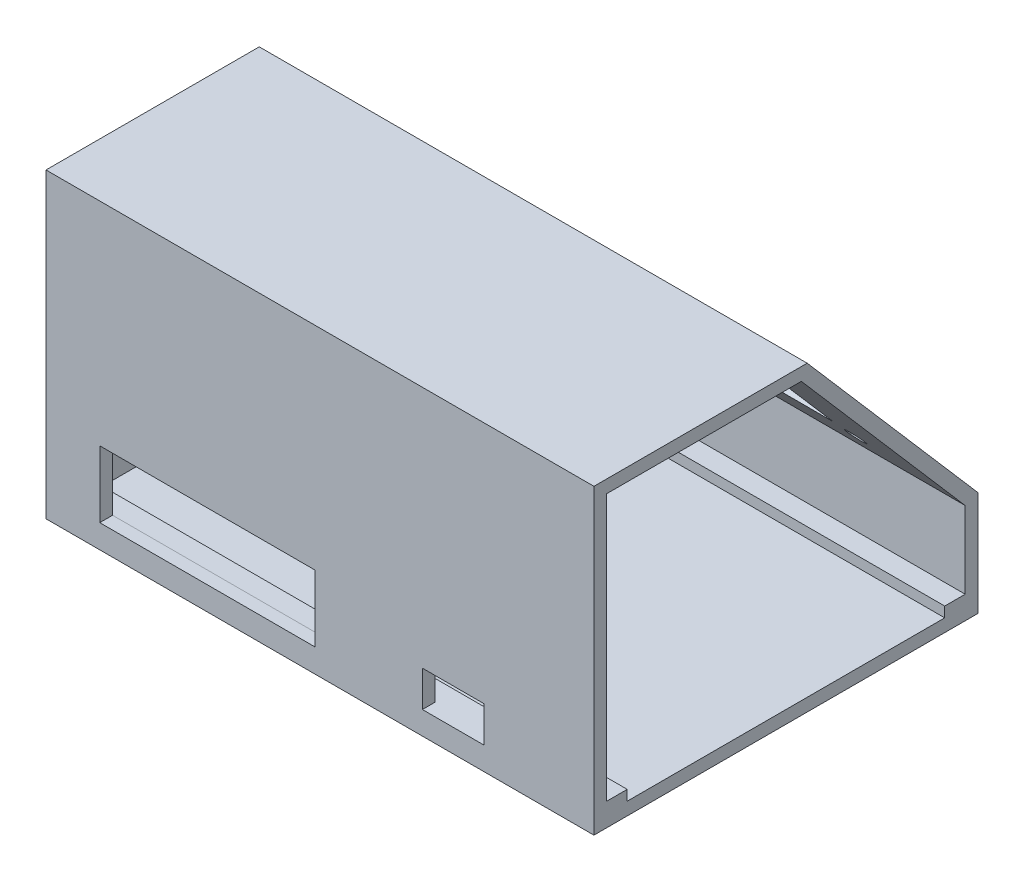
ISO-10303-21;
HEADER;
FILE_DESCRIPTION(('STEP AP214'),'2;1');
FILE_NAME('part.step','',(''),(''),'','','');
FILE_SCHEMA(('AUTOMOTIVE_DESIGN { 1 0 10303 214 1 1 1 1 }'));
ENDSEC;
DATA;
#1=APPLICATION_CONTEXT('core data for automotive mechanical design processes');
#2=APPLICATION_PROTOCOL_DEFINITION('international standard','automotive_design',2000,#1);
#3=PRODUCT_CONTEXT('',#1,'mechanical');
#4=PRODUCT('Part','Part','',(#3));
#5=PRODUCT_RELATED_PRODUCT_CATEGORY('part','',(#4));
#6=PRODUCT_DEFINITION_FORMATION('','',#4);
#7=PRODUCT_DEFINITION_CONTEXT('part definition',#1,'design');
#8=PRODUCT_DEFINITION('design','',#6,#7);
#9=PRODUCT_DEFINITION_SHAPE('','',#8);
#10=(LENGTH_UNIT() NAMED_UNIT(*) SI_UNIT(.MILLI.,.METRE.));
#11=(NAMED_UNIT(*) PLANE_ANGLE_UNIT() SI_UNIT($,.RADIAN.));
#12=(NAMED_UNIT(*) SI_UNIT($,.STERADIAN.) SOLID_ANGLE_UNIT());
#13=UNCERTAINTY_MEASURE_WITH_UNIT(LENGTH_MEASURE(1.E-05),#10,'distance_accuracy_value','');
#14=(GEOMETRIC_REPRESENTATION_CONTEXT(3) GLOBAL_UNCERTAINTY_ASSIGNED_CONTEXT((#13)) GLOBAL_UNIT_ASSIGNED_CONTEXT((#10,
#11,#12)) REPRESENTATION_CONTEXT('',''));
#15=CARTESIAN_POINT('',(0.,0.,0.));
#16=DIRECTION('',(0.,0.,1.));
#17=DIRECTION('',(1.,0.,0.));
#18=AXIS2_PLACEMENT_3D('',#15,#16,#17);
#19=CARTESIAN_POINT('',(2.5,-4.81741573033708,0.));
#20=DIRECTION('',(0.,1.,0.));
#21=DIRECTION('',(0.,0.,1.));
#22=AXIS2_PLACEMENT_3D('',#19,#20,#21);
#23=PLANE('',#22);
#24=DIRECTION('',(0.,0.,1.));
#25=VECTOR('',#24,1.);
#26=CARTESIAN_POINT('',(107.,-4.81741573033708,0.));
#27=LINE('',#26,#25);
#28=CARTESIAN_POINT('',(107.,-4.81741573033708,4.));
#29=VERTEX_POINT('',#28);
#30=CARTESIAN_POINT('',(107.,-4.81741573033708,66.));
#31=VERTEX_POINT('',#30);
#32=EDGE_CURVE('E337',#29,#31,#27,.T.);
#33=ORIENTED_EDGE('',*,*,#32,.F.);
#34=DIRECTION('',(-1.,0.,0.));
#35=VECTOR('',#34,1.);
#36=CARTESIAN_POINT('',(107.,-4.81741573033708,4.));
#37=LINE('',#36,#35);
#38=CARTESIAN_POINT('',(2.5,-4.81741573033708,4.));
#39=VERTEX_POINT('',#38);
#40=EDGE_CURVE('E308',#29,#39,#37,.T.);
#41=ORIENTED_EDGE('',*,*,#40,.T.);
#42=DIRECTION('',(0.,0.,1.));
#43=VECTOR('',#42,1.);
#44=CARTESIAN_POINT('',(2.5,-4.81741573033708,0.));
#45=LINE('',#44,#43);
#46=CARTESIAN_POINT('',(2.5,-4.81741573033708,66.));
#47=VERTEX_POINT('',#46);
#48=EDGE_CURVE('E338',#39,#47,#45,.T.);
#49=ORIENTED_EDGE('',*,*,#48,.T.);
#50=DIRECTION('',(-1.,0.,0.));
#51=VECTOR('',#50,1.);
#52=CARTESIAN_POINT('',(107.,-4.81741573033708,66.));
#53=LINE('',#52,#51);
#54=EDGE_CURVE('E334',#31,#47,#53,.T.);
#55=ORIENTED_EDGE('',*,*,#54,.F.);
#56=EDGE_LOOP('',(#33,#41,#49,#55));
#57=FACE_BOUND('',#56,.T.);
#58=ADVANCED_FACE('F44',(#57),#23,.T.);
#59=CARTESIAN_POINT('',(2.5,0.,0.));
#60=DIRECTION('',(1.,0.,0.));
#61=DIRECTION('',(0.,0.,-1.));
#62=AXIS2_PLACEMENT_3D('',#59,#60,#61);
#63=PLANE('',#62);
#64=DIRECTION('',(0.,-1.,0.));
#65=VECTOR('',#64,1.);
#66=CARTESIAN_POINT('',(2.5,-4.81741573033708,4.));
#67=LINE('',#66,#65);
#68=CARTESIAN_POINT('',(2.5,-2.81741573033708,4.));
#69=VERTEX_POINT('',#68);
#70=EDGE_CURVE('E306',#69,#39,#67,.T.);
#71=ORIENTED_EDGE('',*,*,#70,.F.);
#72=DIRECTION('',(0.,0.,1.));
#73=VECTOR('',#72,1.);
#74=CARTESIAN_POINT('',(2.5,-2.81741573033708,4.));
#75=LINE('',#74,#73);
#76=CARTESIAN_POINT('',(2.5,-2.81741573033708,0.));
#77=VERTEX_POINT('',#76);
#78=EDGE_CURVE('E302',#77,#69,#75,.T.);
#79=ORIENTED_EDGE('',*,*,#78,.F.);
#80=DIRECTION('',(0.,-1.,0.));
#81=VECTOR('',#80,1.);
#82=CARTESIAN_POINT('',(2.5,0.,0.));
#83=LINE('',#82,#81);
#84=CARTESIAN_POINT('',(2.5,12.1825842696629,0.));
#85=VERTEX_POINT('',#84);
#86=EDGE_CURVE('E340',#85,#77,#83,.T.);
#87=ORIENTED_EDGE('',*,*,#86,.F.);
#88=DIRECTION('',(0.,-0.756363172452144,-0.654151932931584));
#89=VECTOR('',#88,1.);
#90=CARTESIAN_POINT('',(2.5,5.21310751865226,-6.02765556844167));
#91=LINE('',#90,#89);
#92=CARTESIAN_POINT('',(2.5,49.1825842696629,32.));
#93=VERTEX_POINT('',#92);
#94=EDGE_CURVE('E344',#93,#85,#91,.T.);
#95=ORIENTED_EDGE('',*,*,#94,.F.);
#96=DIRECTION('',(0.,0.,-1.));
#97=VECTOR('',#96,1.);
#98=CARTESIAN_POINT('',(2.5,49.1825842696629,0.));
#99=LINE('',#98,#97);
#100=CARTESIAN_POINT('',(2.5,49.1825842696629,70.));
#101=VERTEX_POINT('',#100);
#102=EDGE_CURVE('E346',#101,#93,#99,.T.);
#103=ORIENTED_EDGE('',*,*,#102,.F.);
#104=DIRECTION('',(0.,1.,0.));
#105=VECTOR('',#104,1.);
#106=CARTESIAN_POINT('',(2.5,0.,70.));
#107=LINE('',#106,#105);
#108=CARTESIAN_POINT('',(2.5,-2.81741573033708,70.));
#109=VERTEX_POINT('',#108);
#110=EDGE_CURVE('E348',#109,#101,#107,.T.);
#111=ORIENTED_EDGE('',*,*,#110,.F.);
#112=DIRECTION('',(0.,0.,1.));
#113=VECTOR('',#112,1.);
#114=CARTESIAN_POINT('',(2.5,-2.81741573033708,70.));
#115=LINE('',#114,#113);
#116=CARTESIAN_POINT('',(2.5,-2.81741573033708,66.));
#117=VERTEX_POINT('',#116);
#118=EDGE_CURVE('E322',#117,#109,#115,.T.);
#119=ORIENTED_EDGE('',*,*,#118,.F.);
#120=DIRECTION('',(0.,1.,0.));
#121=VECTOR('',#120,1.);
#122=CARTESIAN_POINT('',(2.5,-2.81741573033708,66.));
#123=LINE('',#122,#121);
#124=EDGE_CURVE('E318',#47,#117,#123,.T.);
#125=ORIENTED_EDGE('',*,*,#124,.F.);
#126=ORIENTED_EDGE('',*,*,#48,.F.);
#127=EDGE_LOOP('',(#71,#79,#87,#95,#103,#111,#119,#125,#126));
#128=FACE_BOUND('',#127,.T.);
#129=ADVANCED_FACE('F466',(#128),#63,.T.);
#130=CARTESIAN_POINT('',(2.5,0.,0.));
#131=DIRECTION('',(0.,0.,1.));
#132=DIRECTION('',(1.,0.,0.));
#133=AXIS2_PLACEMENT_3D('',#130,#131,#132);
#134=PLANE('',#133);
#135=ORIENTED_EDGE('',*,*,#86,.T.);
#136=DIRECTION('',(-1.,0.,0.));
#137=VECTOR('',#136,1.);
#138=CARTESIAN_POINT('',(107.,-2.81741573033708,0.));
#139=LINE('',#138,#137);
#140=CARTESIAN_POINT('',(107.,-2.81741573033708,0.));
#141=VERTEX_POINT('',#140);
#142=EDGE_CURVE('E316',#141,#77,#139,.T.);
#143=ORIENTED_EDGE('',*,*,#142,.F.);
#144=DIRECTION('',(0.,-1.,0.));
#145=VECTOR('',#144,1.);
#146=CARTESIAN_POINT('',(107.,0.,0.));
#147=LINE('',#146,#145);
#148=CARTESIAN_POINT('',(107.,12.1825842696629,0.));
#149=VERTEX_POINT('',#148);
#150=EDGE_CURVE('E352',#149,#141,#147,.T.);
#151=ORIENTED_EDGE('',*,*,#150,.F.);
#152=DIRECTION('',(1.,0.,0.));
#153=VECTOR('',#152,1.);
#154=CARTESIAN_POINT('',(2.5,12.1825842696629,0.));
#155=LINE('',#154,#153);
#156=EDGE_CURVE('E350',#85,#149,#155,.T.);
#157=ORIENTED_EDGE('',*,*,#156,.F.);
#158=EDGE_LOOP('',(#135,#143,#151,#157));
#159=FACE_BOUND('',#158,.T.);
#160=ADVANCED_FACE('F472',(#159),#134,.T.);
#161=CARTESIAN_POINT('',(2.5,0.,70.));
#162=DIRECTION('',(0.,0.,-1.));
#163=DIRECTION('',(-1.,0.,0.));
#164=AXIS2_PLACEMENT_3D('',#161,#162,#163);
#165=PLANE('',#164);
#166=DIRECTION('',(0.,1.,0.));
#167=VECTOR('',#166,1.);
#168=CARTESIAN_POINT('',(73.5,0.,70.));
#169=LINE('',#168,#167);
#170=CARTESIAN_POINT('',(73.5,-2.81741573033708,70.));
#171=VERTEX_POINT('',#170);
#172=CARTESIAN_POINT('',(73.5,4.18258426966292,70.));
#173=VERTEX_POINT('',#172);
#174=EDGE_CURVE('E269',#171,#173,#169,.T.);
#175=ORIENTED_EDGE('',*,*,#174,.F.);
#176=DIRECTION('',(-1.,0.,0.));
#177=VECTOR('',#176,1.);
#178=CARTESIAN_POINT('',(107.,-2.81741573033708,70.));
#179=LINE('',#178,#177);
#180=EDGE_CURVE('E324',#171,#109,#179,.T.);
#181=ORIENTED_EDGE('',*,*,#180,.T.);
#182=ORIENTED_EDGE('',*,*,#110,.T.);
#183=DIRECTION('',(1.,0.,0.));
#184=VECTOR('',#183,1.);
#185=CARTESIAN_POINT('',(2.5,49.1825842696629,70.));
#186=LINE('',#185,#184);
#187=CARTESIAN_POINT('',(107.,49.1825842696629,70.));
#188=VERTEX_POINT('',#187);
#189=EDGE_CURVE('E362',#101,#188,#186,.T.);
#190=ORIENTED_EDGE('',*,*,#189,.T.);
#191=DIRECTION('',(0.,1.,0.));
#192=VECTOR('',#191,1.);
#193=CARTESIAN_POINT('',(107.,0.,70.));
#194=LINE('',#193,#192);
#195=CARTESIAN_POINT('',(107.,-2.81741573033708,70.));
#196=VERTEX_POINT('',#195);
#197=EDGE_CURVE('E341',#196,#188,#194,.T.);
#198=ORIENTED_EDGE('',*,*,#197,.F.);
#199=CARTESIAN_POINT('',(85.5,-2.81741573033708,70.));
#200=VERTEX_POINT('',#199);
#201=EDGE_CURVE('E329',#196,#200,#179,.T.);
#202=ORIENTED_EDGE('',*,*,#201,.T.);
#203=DIRECTION('',(0.,-1.,0.));
#204=VECTOR('',#203,1.);
#205=CARTESIAN_POINT('',(85.5,0.,70.));
#206=LINE('',#205,#204);
#207=CARTESIAN_POINT('',(85.5,4.18258426966292,70.));
#208=VERTEX_POINT('',#207);
#209=EDGE_CURVE('E260',#208,#200,#206,.T.);
#210=ORIENTED_EDGE('',*,*,#209,.F.);
#211=DIRECTION('',(1.,0.,0.));
#212=VECTOR('',#211,1.);
#213=CARTESIAN_POINT('',(2.5,4.18258426966292,70.));
#214=LINE('',#213,#212);
#215=EDGE_CURVE('E271',#173,#208,#214,.T.);
#216=ORIENTED_EDGE('',*,*,#215,.F.);
#217=EDGE_LOOP('',(#175,#181,#182,#190,#198,#202,#210,#216));
#218=FACE_BOUND('',#217,.T.);
#219=DIRECTION('',(0.,1.,0.));
#220=VECTOR('',#219,1.);
#221=CARTESIAN_POINT('',(10.5,0.,70.));
#222=LINE('',#221,#220);
#223=CARTESIAN_POINT('',(10.5,-2.71741573033708,70.));
#224=VERTEX_POINT('',#223);
#225=CARTESIAN_POINT('',(10.5,10.2825842696629,70.));
#226=VERTEX_POINT('',#225);
#227=EDGE_CURVE('E300',#224,#226,#222,.T.);
#228=ORIENTED_EDGE('',*,*,#227,.F.);
#229=DIRECTION('',(-1.,0.,0.));
#230=VECTOR('',#229,1.);
#231=CARTESIAN_POINT('',(2.5,-2.71741573033708,70.));
#232=LINE('',#231,#230);
#233=CARTESIAN_POINT('',(52.5,-2.71741573033708,70.));
#234=VERTEX_POINT('',#233);
#235=EDGE_CURVE('E287',#234,#224,#232,.T.);
#236=ORIENTED_EDGE('',*,*,#235,.F.);
#237=DIRECTION('',(0.,-1.,0.));
#238=VECTOR('',#237,1.);
#239=CARTESIAN_POINT('',(52.5,0.,70.));
#240=LINE('',#239,#238);
#241=CARTESIAN_POINT('',(52.5,10.2825842696629,70.));
#242=VERTEX_POINT('',#241);
#243=EDGE_CURVE('E295',#242,#234,#240,.T.);
#244=ORIENTED_EDGE('',*,*,#243,.F.);
#245=DIRECTION('',(1.,0.,0.));
#246=VECTOR('',#245,1.);
#247=CARTESIAN_POINT('',(2.5,10.2825842696629,70.));
#248=LINE('',#247,#246);
#249=EDGE_CURVE('E298',#226,#242,#248,.T.);
#250=ORIENTED_EDGE('',*,*,#249,.F.);
#251=EDGE_LOOP('',(#228,#236,#244,#250));
#252=FACE_BOUND('',#251,.T.);
#253=ADVANCED_FACE('F494',(#218,#252),#165,.T.);
#254=CARTESIAN_POINT('',(107.,0.,0.));
#255=DIRECTION('',(-1.,0.,0.));
#256=DIRECTION('',(0.,0.,1.));
#257=AXIS2_PLACEMENT_3D('',#254,#255,#256);
#258=PLANE('',#257);
#259=DIRECTION('',(0.,-1.,0.));
#260=VECTOR('',#259,1.);
#261=CARTESIAN_POINT('',(107.,-4.81741573033708,4.));
#262=LINE('',#261,#260);
#263=CARTESIAN_POINT('',(107.,-2.81741573033708,4.));
#264=VERTEX_POINT('',#263);
#265=EDGE_CURVE('E305',#264,#29,#262,.T.);
#266=ORIENTED_EDGE('',*,*,#265,.T.);
#267=ORIENTED_EDGE('',*,*,#32,.T.);
#268=DIRECTION('',(0.,1.,0.));
#269=VECTOR('',#268,1.);
#270=CARTESIAN_POINT('',(107.,-2.81741573033708,66.));
#271=LINE('',#270,#269);
#272=CARTESIAN_POINT('',(107.,-2.81741573033708,66.));
#273=VERTEX_POINT('',#272);
#274=EDGE_CURVE('E319',#31,#273,#271,.T.);
#275=ORIENTED_EDGE('',*,*,#274,.T.);
#276=DIRECTION('',(0.,0.,1.));
#277=VECTOR('',#276,1.);
#278=CARTESIAN_POINT('',(107.,-2.81741573033708,70.));
#279=LINE('',#278,#277);
#280=EDGE_CURVE('E321',#273,#196,#279,.T.);
#281=ORIENTED_EDGE('',*,*,#280,.T.);
#282=ORIENTED_EDGE('',*,*,#197,.T.);
#283=DIRECTION('',(0.,0.,-1.));
#284=VECTOR('',#283,1.);
#285=CARTESIAN_POINT('',(107.,49.1825842696629,0.));
#286=LINE('',#285,#284);
#287=CARTESIAN_POINT('',(107.,49.1825842696629,32.));
#288=VERTEX_POINT('',#287);
#289=EDGE_CURVE('E358',#188,#288,#286,.T.);
#290=ORIENTED_EDGE('',*,*,#289,.T.);
#291=DIRECTION('',(0.,-0.756363172452144,-0.654151932931584));
#292=VECTOR('',#291,1.);
#293=CARTESIAN_POINT('',(107.,5.21310751865226,-6.02765556844167));
#294=LINE('',#293,#292);
#295=EDGE_CURVE('E355',#288,#149,#294,.T.);
#296=ORIENTED_EDGE('',*,*,#295,.T.);
#297=ORIENTED_EDGE('',*,*,#150,.T.);
#298=DIRECTION('',(0.,0.,1.));
#299=VECTOR('',#298,1.);
#300=CARTESIAN_POINT('',(107.,-2.81741573033708,4.));
#301=LINE('',#300,#299);
#302=EDGE_CURVE('E303',#141,#264,#301,.T.);
#303=ORIENTED_EDGE('',*,*,#302,.T.);
#304=EDGE_LOOP('',(#266,#267,#275,#281,#282,#290,#296,#297,#303));
#305=FACE_BOUND('',#304,.T.);
#306=DIRECTION('',(0.,0.,-1.));
#307=VECTOR('',#306,1.);
#308=CARTESIAN_POINT('',(107.,-7.31741573033708,-2.5));
#309=LINE('',#308,#307);
#310=CARTESIAN_POINT('',(107.,-7.31741573033708,72.5));
#311=VERTEX_POINT('',#310);
#312=CARTESIAN_POINT('',(107.,-7.31741573033708,-2.5));
#313=VERTEX_POINT('',#312);
#314=EDGE_CURVE('E365',#311,#313,#309,.T.);
#315=ORIENTED_EDGE('',*,*,#314,.T.);
#316=DIRECTION('',(0.,1.,0.));
#317=VECTOR('',#316,1.);
#318=CARTESIAN_POINT('',(107.,13.1137013973614,-2.5));
#319=LINE('',#318,#317);
#320=CARTESIAN_POINT('',(107.,13.1137013973614,-2.5));
#321=VERTEX_POINT('',#320);
#322=EDGE_CURVE('E388',#313,#321,#319,.T.);
#323=ORIENTED_EDGE('',*,*,#322,.T.);
#324=DIRECTION('',(0.,0.756363172452144,0.654151932931584));
#325=VECTOR('',#324,1.);
#326=CARTESIAN_POINT('',(107.,51.6825842696629,30.8568716733419));
#327=LINE('',#326,#325);
#328=CARTESIAN_POINT('',(107.,51.6825842696629,30.8568716733419));
#329=VERTEX_POINT('',#328);
#330=EDGE_CURVE('E391',#321,#329,#327,.T.);
#331=ORIENTED_EDGE('',*,*,#330,.T.);
#332=DIRECTION('',(0.,0.,1.));
#333=VECTOR('',#332,1.);
#334=CARTESIAN_POINT('',(107.,51.6825842696629,72.5));
#335=LINE('',#334,#333);
#336=CARTESIAN_POINT('',(107.,51.6825842696629,72.5));
#337=VERTEX_POINT('',#336);
#338=EDGE_CURVE('E394',#329,#337,#335,.T.);
#339=ORIENTED_EDGE('',*,*,#338,.T.);
#340=DIRECTION('',(0.,-1.,0.));
#341=VECTOR('',#340,1.);
#342=CARTESIAN_POINT('',(107.,-7.31741573033708,72.5));
#343=LINE('',#342,#341);
#344=EDGE_CURVE('E373',#337,#311,#343,.T.);
#345=ORIENTED_EDGE('',*,*,#344,.T.);
#346=EDGE_LOOP('',(#315,#323,#331,#339,#345));
#347=FACE_BOUND('',#346,.T.);
#348=ADVANCED_FACE('F491',(#305,#347),#258,.F.);
#349=CARTESIAN_POINT('',(0.,-7.31741573033708,-2.5));
#350=DIRECTION('',(0.,-1.,0.));
#351=DIRECTION('',(0.,0.,-1.));
#352=AXIS2_PLACEMENT_3D('',#349,#350,#351);
#353=PLANE('',#352);
#354=ORIENTED_EDGE('',*,*,#314,.F.);
#355=DIRECTION('',(1.,0.,0.));
#356=VECTOR('',#355,1.);
#357=CARTESIAN_POINT('',(0.,-7.31741573033708,72.5));
#358=LINE('',#357,#356);
#359=CARTESIAN_POINT('',(0.,-7.31741573033708,72.5));
#360=VERTEX_POINT('',#359);
#361=EDGE_CURVE('E399',#360,#311,#358,.T.);
#362=ORIENTED_EDGE('',*,*,#361,.F.);
#363=DIRECTION('',(0.,0.,-1.));
#364=VECTOR('',#363,1.);
#365=CARTESIAN_POINT('',(0.,-7.31741573033708,-2.5));
#366=LINE('',#365,#364);
#367=CARTESIAN_POINT('',(0.,-7.31741573033708,-2.5));
#368=VERTEX_POINT('',#367);
#369=EDGE_CURVE('E369',#360,#368,#366,.T.);
#370=ORIENTED_EDGE('',*,*,#369,.T.);
#371=DIRECTION('',(1.,0.,0.));
#372=VECTOR('',#371,1.);
#373=CARTESIAN_POINT('',(0.,-7.31741573033708,-2.5));
#374=LINE('',#373,#372);
#375=EDGE_CURVE('E385',#368,#313,#374,.T.);
#376=ORIENTED_EDGE('',*,*,#375,.T.);
#377=EDGE_LOOP('',(#354,#362,#370,#376));
#378=FACE_BOUND('',#377,.T.);
#379=ADVANCED_FACE('F482',(#378),#353,.T.);
#380=CARTESIAN_POINT('',(0.,-7.31741573033708,72.5));
#381=DIRECTION('',(0.,0.,1.));
#382=DIRECTION('',(1.,0.,0.));
#383=AXIS2_PLACEMENT_3D('',#380,#381,#382);
#384=PLANE('',#383);
#385=DIRECTION('',(0.,-1.,0.));
#386=VECTOR('',#385,1.);
#387=CARTESIAN_POINT('',(73.5,4.18258426966292,72.5));
#388=LINE('',#387,#386);
#389=CARTESIAN_POINT('',(73.5,4.18258426966292,72.5));
#390=VERTEX_POINT('',#389);
#391=CARTESIAN_POINT('',(73.5,-2.81741573033708,72.5));
#392=VERTEX_POINT('',#391);
#393=EDGE_CURVE('E244',#390,#392,#388,.T.);
#394=ORIENTED_EDGE('',*,*,#393,.F.);
#395=DIRECTION('',(-1.,0.,0.));
#396=VECTOR('',#395,1.);
#397=CARTESIAN_POINT('',(73.5,4.18258426966292,72.5));
#398=LINE('',#397,#396);
#399=CARTESIAN_POINT('',(85.5,4.18258426966292,72.5));
#400=VERTEX_POINT('',#399);
#401=EDGE_CURVE('E254',#400,#390,#398,.T.);
#402=ORIENTED_EDGE('',*,*,#401,.F.);
#403=DIRECTION('',(0.,1.,0.));
#404=VECTOR('',#403,1.);
#405=CARTESIAN_POINT('',(85.5,4.18258426966292,72.5));
#406=LINE('',#405,#404);
#407=CARTESIAN_POINT('',(85.5,-2.81741573033708,72.5));
#408=VERTEX_POINT('',#407);
#409=EDGE_CURVE('E251',#408,#400,#406,.T.);
#410=ORIENTED_EDGE('',*,*,#409,.F.);
#411=DIRECTION('',(1.,0.,0.));
#412=VECTOR('',#411,1.);
#413=CARTESIAN_POINT('',(73.5,-2.81741573033708,72.5));
#414=LINE('',#413,#412);
#415=EDGE_CURVE('E248',#392,#408,#414,.T.);
#416=ORIENTED_EDGE('',*,*,#415,.F.);
#417=EDGE_LOOP('',(#394,#402,#410,#416));
#418=FACE_BOUND('',#417,.T.);
#419=DIRECTION('',(0.,-1.,0.));
#420=VECTOR('',#419,1.);
#421=CARTESIAN_POINT('',(10.5,-2.71741573033708,72.5));
#422=LINE('',#421,#420);
#423=CARTESIAN_POINT('',(10.5,10.2825842696629,72.5));
#424=VERTEX_POINT('',#423);
#425=CARTESIAN_POINT('',(10.5,-2.71741573033708,72.5));
#426=VERTEX_POINT('',#425);
#427=EDGE_CURVE('E273',#424,#426,#422,.T.);
#428=ORIENTED_EDGE('',*,*,#427,.F.);
#429=DIRECTION('',(-1.,0.,0.));
#430=VECTOR('',#429,1.);
#431=CARTESIAN_POINT('',(10.5,10.2825842696629,72.5));
#432=LINE('',#431,#430);
#433=CARTESIAN_POINT('',(52.5,10.2825842696629,72.5));
#434=VERTEX_POINT('',#433);
#435=EDGE_CURVE('E281',#434,#424,#432,.T.);
#436=ORIENTED_EDGE('',*,*,#435,.F.);
#437=DIRECTION('',(0.,1.,0.));
#438=VECTOR('',#437,1.);
#439=CARTESIAN_POINT('',(52.5,-2.71741573033708,72.5));
#440=LINE('',#439,#438);
#441=CARTESIAN_POINT('',(52.5,-2.71741573033708,72.5));
#442=VERTEX_POINT('',#441);
#443=EDGE_CURVE('E278',#442,#434,#440,.T.);
#444=ORIENTED_EDGE('',*,*,#443,.F.);
#445=DIRECTION('',(1.,0.,0.));
#446=VECTOR('',#445,1.);
#447=CARTESIAN_POINT('',(10.5,-2.71741573033708,72.5));
#448=LINE('',#447,#446);
#449=EDGE_CURVE('E275',#426,#442,#448,.T.);
#450=ORIENTED_EDGE('',*,*,#449,.F.);
#451=EDGE_LOOP('',(#428,#436,#444,#450));
#452=FACE_BOUND('',#451,.T.);
#453=ORIENTED_EDGE('',*,*,#344,.F.);
#454=DIRECTION('',(1.,0.,0.));
#455=VECTOR('',#454,1.);
#456=CARTESIAN_POINT('',(0.,51.6825842696629,72.5));
#457=LINE('',#456,#455);
#458=CARTESIAN_POINT('',(0.,51.6825842696629,72.5));
#459=VERTEX_POINT('',#458);
#460=EDGE_CURVE('E402',#459,#337,#457,.T.);
#461=ORIENTED_EDGE('',*,*,#460,.F.);
#462=DIRECTION('',(0.,-1.,0.));
#463=VECTOR('',#462,1.);
#464=CARTESIAN_POINT('',(0.,-7.31741573033708,72.5));
#465=LINE('',#464,#463);
#466=EDGE_CURVE('E382',#459,#360,#465,.T.);
#467=ORIENTED_EDGE('',*,*,#466,.T.);
#468=ORIENTED_EDGE('',*,*,#361,.T.);
#469=EDGE_LOOP('',(#453,#461,#467,#468));
#470=FACE_BOUND('',#469,.T.);
#471=ADVANCED_FACE('F479',(#418,#452,#470),#384,.T.);
#472=CARTESIAN_POINT('',(0.,51.6825842696629,72.5));
#473=DIRECTION('',(0.,1.,0.));
#474=DIRECTION('',(0.,0.,1.));
#475=AXIS2_PLACEMENT_3D('',#472,#473,#474);
#476=PLANE('',#475);
#477=ORIENTED_EDGE('',*,*,#338,.F.);
#478=DIRECTION('',(1.,0.,0.));
#479=VECTOR('',#478,1.);
#480=CARTESIAN_POINT('',(0.,51.6825842696629,30.8568716733419));
#481=LINE('',#480,#479);
#482=CARTESIAN_POINT('',(0.,51.6825842696629,30.8568716733419));
#483=VERTEX_POINT('',#482);
#484=EDGE_CURVE('E404',#483,#329,#481,.T.);
#485=ORIENTED_EDGE('',*,*,#484,.F.);
#486=DIRECTION('',(0.,0.,1.));
#487=VECTOR('',#486,1.);
#488=CARTESIAN_POINT('',(0.,51.6825842696629,72.5));
#489=LINE('',#488,#487);
#490=EDGE_CURVE('E379',#483,#459,#489,.T.);
#491=ORIENTED_EDGE('',*,*,#490,.T.);
#492=ORIENTED_EDGE('',*,*,#460,.T.);
#493=EDGE_LOOP('',(#477,#485,#491,#492));
#494=FACE_BOUND('',#493,.T.);
#495=ADVANCED_FACE('F445',(#494),#476,.T.);
#496=CARTESIAN_POINT('',(0.,51.6825842696629,30.8568716733419));
#497=DIRECTION('',(0.,0.654151932931584,-0.756363172452144));
#498=DIRECTION('',(0.,0.756363172452144,0.654151932931584));
#499=AXIS2_PLACEMENT_3D('',#496,#497,#498);
#500=PLANE('',#499);
#501=CARTESIAN_POINT('',(15.4068290893679,45.5182244141779,25.5255334199495));
#502=DIRECTION('',(0.,0.654151932931585,-0.756363172452144));
#503=DIRECTION('',(0.,0.756363172452144,0.654151932931584));
#504=AXIS2_PLACEMENT_3D('',#501,#502,#503);
#505=CIRCLE('',#504,1.85000000000001);
#506=CARTESIAN_POINT('',(15.4068290893679,46.9174962832144,26.7357144958729));
#507=VERTEX_POINT('',#506);
#508=EDGE_CURVE('E419',#507,#507,#505,.T.);
#509=ORIENTED_EDGE('',*,*,#508,.F.);
#510=EDGE_LOOP('',(#509));
#511=FACE_BOUND('',#510,.T.);
#512=CARTESIAN_POINT('',(15.4068290893675,20.7851486749928,4.13476521308668));
#513=DIRECTION('',(0.,0.654151932931585,-0.756363172452144));
#514=DIRECTION('',(0.,0.756363172452144,0.654151932931584));
#515=AXIS2_PLACEMENT_3D('',#512,#513,#514);
#516=CIRCLE('',#515,1.85000000000001);
#517=CARTESIAN_POINT('',(15.4068290893675,22.1844205440293,5.34494628901012));
#518=VERTEX_POINT('',#517);
#519=EDGE_CURVE('E434',#518,#518,#516,.T.);
#520=ORIENTED_EDGE('',*,*,#519,.F.);
#521=EDGE_LOOP('',(#520));
#522=FACE_BOUND('',#521,.T.);
#523=CARTESIAN_POINT('',(91.6068290893675,20.7851486749928,4.13476521308668));
#524=DIRECTION('',(0.,0.654151932931585,-0.756363172452144));
#525=DIRECTION('',(0.,0.756363172452144,0.654151932931584));
#526=AXIS2_PLACEMENT_3D('',#523,#524,#525);
#527=CIRCLE('',#526,1.85000000000001);
#528=CARTESIAN_POINT('',(91.6068290893675,22.1844205440293,5.34494628901012));
#529=VERTEX_POINT('',#528);
#530=EDGE_CURVE('E431',#529,#529,#527,.T.);
#531=ORIENTED_EDGE('',*,*,#530,.F.);
#532=EDGE_LOOP('',(#531));
#533=FACE_BOUND('',#532,.T.);
#534=CARTESIAN_POINT('',(91.6068290893679,45.5182244141779,25.5255334199495));
#535=DIRECTION('',(0.,0.654151932931585,-0.756363172452144));
#536=DIRECTION('',(0.,0.756363172452144,0.654151932931584));
#537=AXIS2_PLACEMENT_3D('',#534,#535,#536);
#538=CIRCLE('',#537,1.85000000000001);
#539=CARTESIAN_POINT('',(91.6068290893679,46.9174962832144,26.7357144958729));
#540=VERTEX_POINT('',#539);
#541=EDGE_CURVE('E415',#540,#540,#538,.T.);
#542=ORIENTED_EDGE('',*,*,#541,.F.);
#543=EDGE_LOOP('',(#542));
#544=FACE_BOUND('',#543,.T.);
#545=DIRECTION('',(0.,-0.756363172452144,-0.654151932931584));
#546=VECTOR('',#545,1.);
#547=CARTESIAN_POINT('',(89.5,23.3189653027075,6.32617418840749));
#548=LINE('',#547,#546);
#549=CARTESIAN_POINT('',(89.5,42.9844077864633,23.3341244446287));
#550=VERTEX_POINT('',#549);
#551=CARTESIAN_POINT('',(89.5,23.3189653027075,6.32617418840748));
#552=VERTEX_POINT('',#551);
#553=EDGE_CURVE('E61',#550,#552,#548,.T.);
#554=ORIENTED_EDGE('',*,*,#553,.F.);
#555=DIRECTION('',(1.,0.,0.));
#556=VECTOR('',#555,1.);
#557=CARTESIAN_POINT('',(17.5,42.9844077864633,23.3341244446287));
#558=LINE('',#557,#556);
#559=CARTESIAN_POINT('',(17.5,42.9844077864633,23.3341244446287));
#560=VERTEX_POINT('',#559);
#561=EDGE_CURVE('E237',#560,#550,#558,.T.);
#562=ORIENTED_EDGE('',*,*,#561,.F.);
#563=DIRECTION('',(0.,0.756363172452144,0.654151932931585));
#564=VECTOR('',#563,1.);
#565=CARTESIAN_POINT('',(17.5,23.3189653027075,6.3261741884075));
#566=LINE('',#565,#564);
#567=CARTESIAN_POINT('',(17.5,23.3189653027075,6.3261741884075));
#568=VERTEX_POINT('',#567);
#569=EDGE_CURVE('E221',#568,#560,#566,.T.);
#570=ORIENTED_EDGE('',*,*,#569,.F.);
#571=DIRECTION('',(-1.,0.,0.));
#572=VECTOR('',#571,1.);
#573=CARTESIAN_POINT('',(17.5,23.3189653027075,6.3261741884075));
#574=LINE('',#573,#572);
#575=EDGE_CURVE('E230',#552,#568,#574,.T.);
#576=ORIENTED_EDGE('',*,*,#575,.F.);
#577=EDGE_LOOP('',(#554,#562,#570,#576));
#578=FACE_BOUND('',#577,.T.);
#579=ORIENTED_EDGE('',*,*,#330,.F.);
#580=DIRECTION('',(1.,0.,0.));
#581=VECTOR('',#580,1.);
#582=CARTESIAN_POINT('',(0.,13.1137013973614,-2.5));
#583=LINE('',#582,#581);
#584=CARTESIAN_POINT('',(0.,13.1137013973614,-2.5));
#585=VERTEX_POINT('',#584);
#586=EDGE_CURVE('E406',#585,#321,#583,.T.);
#587=ORIENTED_EDGE('',*,*,#586,.F.);
#588=DIRECTION('',(0.,0.756363172452144,0.654151932931584));
#589=VECTOR('',#588,1.);
#590=CARTESIAN_POINT('',(0.,51.6825842696629,30.8568716733419));
#591=LINE('',#590,#589);
#592=EDGE_CURVE('E376',#585,#483,#591,.T.);
#593=ORIENTED_EDGE('',*,*,#592,.T.);
#594=ORIENTED_EDGE('',*,*,#484,.T.);
#595=EDGE_LOOP('',(#579,#587,#593,#594));
#596=FACE_BOUND('',#595,.T.);
#597=ADVANCED_FACE('F234',(#511,#522,#533,#544,#578,#596),#500,.T.);
#598=CARTESIAN_POINT('',(0.,13.1137013973614,-2.5));
#599=DIRECTION('',(0.,0.,-1.));
#600=DIRECTION('',(-1.,0.,0.));
#601=AXIS2_PLACEMENT_3D('',#598,#599,#600);
#602=PLANE('',#601);
#603=ORIENTED_EDGE('',*,*,#322,.F.);
#604=ORIENTED_EDGE('',*,*,#375,.F.);
#605=DIRECTION('',(0.,1.,0.));
#606=VECTOR('',#605,1.);
#607=CARTESIAN_POINT('',(0.,13.1137013973614,-2.5));
#608=LINE('',#607,#606);
#609=EDGE_CURVE('E372',#368,#585,#608,.T.);
#610=ORIENTED_EDGE('',*,*,#609,.T.);
#611=ORIENTED_EDGE('',*,*,#586,.T.);
#612=EDGE_LOOP('',(#603,#604,#610,#611));
#613=FACE_BOUND('',#612,.T.);
#614=ADVANCED_FACE('F444',(#613),#602,.T.);
#615=CARTESIAN_POINT('',(0.,0.,0.));
#616=DIRECTION('',(-1.,0.,0.));
#617=DIRECTION('',(0.,0.,1.));
#618=AXIS2_PLACEMENT_3D('',#615,#616,#617);
#619=PLANE('',#618);
#620=ORIENTED_EDGE('',*,*,#369,.F.);
#621=ORIENTED_EDGE('',*,*,#466,.F.);
#622=ORIENTED_EDGE('',*,*,#490,.F.);
#623=ORIENTED_EDGE('',*,*,#592,.F.);
#624=ORIENTED_EDGE('',*,*,#609,.F.);
#625=EDGE_LOOP('',(#620,#621,#622,#623,#624));
#626=FACE_BOUND('',#625,.T.);
#627=ADVANCED_FACE('F46',(#626),#619,.T.);
#628=CARTESIAN_POINT('',(2.5,49.1825842696629,0.));
#629=DIRECTION('',(0.,-1.,0.));
#630=DIRECTION('',(0.,0.,-1.));
#631=AXIS2_PLACEMENT_3D('',#628,#629,#630);
#632=PLANE('',#631);
#633=ORIENTED_EDGE('',*,*,#289,.F.);
#634=ORIENTED_EDGE('',*,*,#189,.F.);
#635=ORIENTED_EDGE('',*,*,#102,.T.);
#636=DIRECTION('',(1.,0.,0.));
#637=VECTOR('',#636,1.);
#638=CARTESIAN_POINT('',(2.5,49.1825842696629,32.));
#639=LINE('',#638,#637);
#640=EDGE_CURVE('E366',#93,#288,#639,.T.);
#641=ORIENTED_EDGE('',*,*,#640,.T.);
#642=EDGE_LOOP('',(#633,#634,#635,#641));
#643=FACE_BOUND('',#642,.T.);
#644=ADVANCED_FACE('F517',(#643),#632,.T.);
#645=CARTESIAN_POINT('',(2.5,5.21310751865226,-6.02765556844167));
#646=DIRECTION('',(0.,-0.654151932931584,0.756363172452144));
#647=DIRECTION('',(0.,-0.756363172452144,-0.654151932931584));
#648=AXIS2_PLACEMENT_3D('',#645,#646,#647);
#649=PLANE('',#648);
#650=CARTESIAN_POINT('',(15.4068290893679,43.882844581849,27.4164413510798));
#651=DIRECTION('',(0.,-0.654151932931584,0.756363172452144));
#652=DIRECTION('',(0.,-0.756363172452144,-0.654151932931584));
#653=AXIS2_PLACEMENT_3D('',#650,#651,#652);
#654=CIRCLE('',#653,1.85000000000001);
#655=CARTESIAN_POINT('',(15.4068290893679,42.4835727128125,26.2062602751564));
#656=VERTEX_POINT('',#655);
#657=EDGE_CURVE('E48',#656,#656,#654,.T.);
#658=ORIENTED_EDGE('',*,*,#657,.F.);
#659=EDGE_LOOP('',(#658));
#660=FACE_BOUND('',#659,.T.);
#661=CARTESIAN_POINT('',(15.4068290893675,19.1497688426639,6.02567314421704));
#662=DIRECTION('',(0.,-0.654151932931584,0.756363172452144));
#663=DIRECTION('',(0.,-0.756363172452144,-0.654151932931584));
#664=AXIS2_PLACEMENT_3D('',#661,#662,#663);
#665=CIRCLE('',#664,1.85000000000001);
#666=CARTESIAN_POINT('',(15.4068290893675,17.7504969736274,4.8154920682936));
#667=VERTEX_POINT('',#666);
#668=EDGE_CURVE('E418',#667,#667,#665,.T.);
#669=ORIENTED_EDGE('',*,*,#668,.F.);
#670=EDGE_LOOP('',(#669));
#671=FACE_BOUND('',#670,.T.);
#672=CARTESIAN_POINT('',(91.6068290893675,19.1497688426639,6.02567314421704));
#673=DIRECTION('',(0.,-0.654151932931584,0.756363172452144));
#674=DIRECTION('',(0.,-0.756363172452144,-0.654151932931584));
#675=AXIS2_PLACEMENT_3D('',#672,#673,#674);
#676=CIRCLE('',#675,1.85000000000001);
#677=CARTESIAN_POINT('',(91.6068290893675,17.7504969736274,4.8154920682936));
#678=VERTEX_POINT('',#677);
#679=EDGE_CURVE('E416',#678,#678,#676,.T.);
#680=ORIENTED_EDGE('',*,*,#679,.F.);
#681=EDGE_LOOP('',(#680));
#682=FACE_BOUND('',#681,.T.);
#683=CARTESIAN_POINT('',(91.6068290893679,43.882844581849,27.4164413510798));
#684=DIRECTION('',(0.,-0.654151932931584,0.756363172452144));
#685=DIRECTION('',(0.,-0.756363172452144,-0.654151932931584));
#686=AXIS2_PLACEMENT_3D('',#683,#684,#685);
#687=CIRCLE('',#686,1.85000000000001);
#688=CARTESIAN_POINT('',(91.6068290893679,42.4835727128125,26.2062602751564));
#689=VERTEX_POINT('',#688);
#690=EDGE_CURVE('E412',#689,#689,#687,.T.);
#691=ORIENTED_EDGE('',*,*,#690,.F.);
#692=EDGE_LOOP('',(#691));
#693=FACE_BOUND('',#692,.T.);
#694=DIRECTION('',(0.,0.756363172452144,0.654151932931584));
#695=VECTOR('',#694,1.);
#696=CARTESIAN_POINT('',(89.5,5.21310751865226,-6.02765556844167));
#697=LINE('',#696,#695);
#698=CARTESIAN_POINT('',(89.5,21.6835854703786,8.21708211953784));
#699=VERTEX_POINT('',#698);
#700=CARTESIAN_POINT('',(89.5,41.3490279541343,25.225032375759));
#701=VERTEX_POINT('',#700);
#702=EDGE_CURVE('E13',#699,#701,#697,.T.);
#703=ORIENTED_EDGE('',*,*,#702,.F.);
#704=DIRECTION('',(1.,0.,0.));
#705=VECTOR('',#704,1.);
#706=CARTESIAN_POINT('',(2.50000000000001,21.6835854703786,8.21708211953785));
#707=LINE('',#706,#705);
#708=CARTESIAN_POINT('',(17.5,21.6835854703786,8.21708211953785));
#709=VERTEX_POINT('',#708);
#710=EDGE_CURVE('E401',#709,#699,#707,.T.);
#711=ORIENTED_EDGE('',*,*,#710,.F.);
#712=DIRECTION('',(0.,-0.756363172452144,-0.654151932931584));
#713=VECTOR('',#712,1.);
#714=CARTESIAN_POINT('',(17.5,5.21310751865226,-6.02765556844167));
#715=LINE('',#714,#713);
#716=CARTESIAN_POINT('',(17.5,41.3490279541343,25.225032375759));
#717=VERTEX_POINT('',#716);
#718=EDGE_CURVE('E224',#717,#709,#715,.T.);
#719=ORIENTED_EDGE('',*,*,#718,.F.);
#720=DIRECTION('',(-1.,0.,0.));
#721=VECTOR('',#720,1.);
#722=CARTESIAN_POINT('',(2.5,41.3490279541343,25.225032375759));
#723=LINE('',#722,#721);
#724=EDGE_CURVE('E53',#701,#717,#723,.T.);
#725=ORIENTED_EDGE('',*,*,#724,.F.);
#726=EDGE_LOOP('',(#703,#711,#719,#725));
#727=FACE_BOUND('',#726,.T.);
#728=ORIENTED_EDGE('',*,*,#295,.F.);
#729=ORIENTED_EDGE('',*,*,#640,.F.);
#730=ORIENTED_EDGE('',*,*,#94,.T.);
#731=ORIENTED_EDGE('',*,*,#156,.T.);
#732=EDGE_LOOP('',(#728,#729,#730,#731));
#733=FACE_BOUND('',#732,.T.);
#734=ADVANCED_FACE('F521',(#660,#671,#682,#693,#727,#733),#649,.T.);
#735=CARTESIAN_POINT('',(107.,-2.81741573033708,66.));
#736=DIRECTION('',(0.,0.,1.));
#737=DIRECTION('',(1.,0.,0.));
#738=AXIS2_PLACEMENT_3D('',#735,#736,#737);
#739=PLANE('',#738);
#740=ORIENTED_EDGE('',*,*,#124,.T.);
#741=DIRECTION('',(-1.,0.,0.));
#742=VECTOR('',#741,1.);
#743=CARTESIAN_POINT('',(107.,-2.81741573033708,66.));
#744=LINE('',#743,#742);
#745=EDGE_CURVE('E332',#273,#117,#744,.T.);
#746=ORIENTED_EDGE('',*,*,#745,.F.);
#747=ORIENTED_EDGE('',*,*,#274,.F.);
#748=ORIENTED_EDGE('',*,*,#54,.T.);
#749=EDGE_LOOP('',(#740,#746,#747,#748));
#750=FACE_BOUND('',#749,.T.);
#751=ADVANCED_FACE('F527',(#750),#739,.F.);
#752=CARTESIAN_POINT('',(107.,-2.81741573033708,70.));
#753=DIRECTION('',(0.,-1.,0.));
#754=DIRECTION('',(0.,0.,-1.));
#755=AXIS2_PLACEMENT_3D('',#752,#753,#754);
#756=PLANE('',#755);
#757=ORIENTED_EDGE('',*,*,#180,.F.);
#758=DIRECTION('',(0.,0.,1.));
#759=VECTOR('',#758,1.);
#760=CARTESIAN_POINT('',(73.5,-2.81741573033708,69.5));
#761=LINE('',#760,#759);
#762=EDGE_CURVE('E257',#171,#392,#761,.T.);
#763=ORIENTED_EDGE('',*,*,#762,.T.);
#764=ORIENTED_EDGE('',*,*,#415,.T.);
#765=DIRECTION('',(0.,0.,1.));
#766=VECTOR('',#765,1.);
#767=CARTESIAN_POINT('',(85.5,-2.81741573033708,69.5));
#768=LINE('',#767,#766);
#769=EDGE_CURVE('E263',#200,#408,#768,.T.);
#770=ORIENTED_EDGE('',*,*,#769,.F.);
#771=ORIENTED_EDGE('',*,*,#201,.F.);
#772=ORIENTED_EDGE('',*,*,#280,.F.);
#773=ORIENTED_EDGE('',*,*,#745,.T.);
#774=ORIENTED_EDGE('',*,*,#118,.T.);
#775=EDGE_LOOP('',(#757,#763,#764,#770,#771,#772,#773,#774));
#776=FACE_BOUND('',#775,.T.);
#777=ADVANCED_FACE('F533',(#776),#756,.F.);
#778=CARTESIAN_POINT('',(107.,-2.81741573033708,4.));
#779=DIRECTION('',(0.,-1.,0.));
#780=DIRECTION('',(0.,0.,-1.));
#781=AXIS2_PLACEMENT_3D('',#778,#779,#780);
#782=PLANE('',#781);
#783=ORIENTED_EDGE('',*,*,#78,.T.);
#784=DIRECTION('',(-1.,0.,0.));
#785=VECTOR('',#784,1.);
#786=CARTESIAN_POINT('',(107.,-2.81741573033708,4.));
#787=LINE('',#786,#785);
#788=EDGE_CURVE('E313',#264,#69,#787,.T.);
#789=ORIENTED_EDGE('',*,*,#788,.F.);
#790=ORIENTED_EDGE('',*,*,#302,.F.);
#791=ORIENTED_EDGE('',*,*,#142,.T.);
#792=EDGE_LOOP('',(#783,#789,#790,#791));
#793=FACE_BOUND('',#792,.T.);
#794=ADVANCED_FACE('F537',(#793),#782,.F.);
#795=CARTESIAN_POINT('',(107.,-4.81741573033708,4.));
#796=DIRECTION('',(0.,0.,-1.));
#797=DIRECTION('',(-1.,0.,0.));
#798=AXIS2_PLACEMENT_3D('',#795,#796,#797);
#799=PLANE('',#798);
#800=ORIENTED_EDGE('',*,*,#70,.T.);
#801=ORIENTED_EDGE('',*,*,#40,.F.);
#802=ORIENTED_EDGE('',*,*,#265,.F.);
#803=ORIENTED_EDGE('',*,*,#788,.T.);
#804=EDGE_LOOP('',(#800,#801,#802,#803));
#805=FACE_BOUND('',#804,.T.);
#806=ADVANCED_FACE('F541',(#805),#799,.F.);
#807=CARTESIAN_POINT('',(10.5,-2.71741573033708,69.5));
#808=DIRECTION('',(-1.,0.,0.));
#809=DIRECTION('',(0.,-1.,0.));
#810=AXIS2_PLACEMENT_3D('',#807,#808,#809);
#811=PLANE('',#810);
#812=ORIENTED_EDGE('',*,*,#227,.T.);
#813=DIRECTION('',(0.,0.,1.));
#814=VECTOR('',#813,1.);
#815=CARTESIAN_POINT('',(10.5,10.2825842696629,69.5));
#816=LINE('',#815,#814);
#817=EDGE_CURVE('E285',#226,#424,#816,.T.);
#818=ORIENTED_EDGE('',*,*,#817,.T.);
#819=ORIENTED_EDGE('',*,*,#427,.T.);
#820=DIRECTION('',(0.,0.,1.));
#821=VECTOR('',#820,1.);
#822=CARTESIAN_POINT('',(10.5,-2.71741573033708,69.5));
#823=LINE('',#822,#821);
#824=EDGE_CURVE('E284',#224,#426,#823,.T.);
#825=ORIENTED_EDGE('',*,*,#824,.F.);
#826=EDGE_LOOP('',(#812,#818,#819,#825));
#827=FACE_BOUND('',#826,.T.);
#828=ADVANCED_FACE('F545',(#827),#811,.F.);
#829=CARTESIAN_POINT('',(10.5,10.2825842696629,69.5));
#830=DIRECTION('',(0.,1.,0.));
#831=DIRECTION('',(0.,0.,1.));
#832=AXIS2_PLACEMENT_3D('',#829,#830,#831);
#833=PLANE('',#832);
#834=ORIENTED_EDGE('',*,*,#249,.T.);
#835=DIRECTION('',(0.,0.,1.));
#836=VECTOR('',#835,1.);
#837=CARTESIAN_POINT('',(52.5,10.2825842696629,69.5));
#838=LINE('',#837,#836);
#839=EDGE_CURVE('E288',#242,#434,#838,.T.);
#840=ORIENTED_EDGE('',*,*,#839,.T.);
#841=ORIENTED_EDGE('',*,*,#435,.T.);
#842=ORIENTED_EDGE('',*,*,#817,.F.);
#843=EDGE_LOOP('',(#834,#840,#841,#842));
#844=FACE_BOUND('',#843,.T.);
#845=ADVANCED_FACE('F549',(#844),#833,.F.);
#846=CARTESIAN_POINT('',(52.5,-2.71741573033708,69.5));
#847=DIRECTION('',(1.,0.,0.));
#848=DIRECTION('',(0.,0.,-1.));
#849=AXIS2_PLACEMENT_3D('',#846,#847,#848);
#850=PLANE('',#849);
#851=ORIENTED_EDGE('',*,*,#243,.T.);
#852=DIRECTION('',(0.,0.,1.));
#853=VECTOR('',#852,1.);
#854=CARTESIAN_POINT('',(52.5,-2.71741573033708,69.5));
#855=LINE('',#854,#853);
#856=EDGE_CURVE('E290',#234,#442,#855,.T.);
#857=ORIENTED_EDGE('',*,*,#856,.T.);
#858=ORIENTED_EDGE('',*,*,#443,.T.);
#859=ORIENTED_EDGE('',*,*,#839,.F.);
#860=EDGE_LOOP('',(#851,#857,#858,#859));
#861=FACE_BOUND('',#860,.T.);
#862=ADVANCED_FACE('F555',(#861),#850,.F.);
#863=CARTESIAN_POINT('',(10.5,-2.71741573033708,69.5));
#864=DIRECTION('',(0.,-1.,0.));
#865=DIRECTION('',(0.,0.,-1.));
#866=AXIS2_PLACEMENT_3D('',#863,#864,#865);
#867=PLANE('',#866);
#868=ORIENTED_EDGE('',*,*,#235,.T.);
#869=ORIENTED_EDGE('',*,*,#824,.T.);
#870=ORIENTED_EDGE('',*,*,#449,.T.);
#871=ORIENTED_EDGE('',*,*,#856,.F.);
#872=EDGE_LOOP('',(#868,#869,#870,#871));
#873=FACE_BOUND('',#872,.T.);
#874=ADVANCED_FACE('F551',(#873),#867,.F.);
#875=CARTESIAN_POINT('',(73.5,4.18258426966292,69.5));
#876=DIRECTION('',(-1.,0.,0.));
#877=DIRECTION('',(0.,0.,1.));
#878=AXIS2_PLACEMENT_3D('',#875,#876,#877);
#879=PLANE('',#878);
#880=ORIENTED_EDGE('',*,*,#174,.T.);
#881=DIRECTION('',(0.,0.,1.));
#882=VECTOR('',#881,1.);
#883=CARTESIAN_POINT('',(73.5,4.18258426966292,69.5));
#884=LINE('',#883,#882);
#885=EDGE_CURVE('E258',#173,#390,#884,.T.);
#886=ORIENTED_EDGE('',*,*,#885,.T.);
#887=ORIENTED_EDGE('',*,*,#393,.T.);
#888=ORIENTED_EDGE('',*,*,#762,.F.);
#889=EDGE_LOOP('',(#880,#886,#887,#888));
#890=FACE_BOUND('',#889,.T.);
#891=ADVANCED_FACE('F554',(#890),#879,.F.);
#892=CARTESIAN_POINT('',(73.5,4.18258426966292,69.5));
#893=DIRECTION('',(0.,1.,0.));
#894=DIRECTION('',(0.,0.,1.));
#895=AXIS2_PLACEMENT_3D('',#892,#893,#894);
#896=PLANE('',#895);
#897=ORIENTED_EDGE('',*,*,#215,.T.);
#898=DIRECTION('',(0.,0.,1.));
#899=VECTOR('',#898,1.);
#900=CARTESIAN_POINT('',(85.5,4.18258426966292,69.5));
#901=LINE('',#900,#899);
#902=EDGE_CURVE('E261',#208,#400,#901,.T.);
#903=ORIENTED_EDGE('',*,*,#902,.T.);
#904=ORIENTED_EDGE('',*,*,#401,.T.);
#905=ORIENTED_EDGE('',*,*,#885,.F.);
#906=EDGE_LOOP('',(#897,#903,#904,#905));
#907=FACE_BOUND('',#906,.T.);
#908=ADVANCED_FACE('F565',(#907),#896,.F.);
#909=CARTESIAN_POINT('',(85.5,4.18258426966292,69.5));
#910=DIRECTION('',(1.,0.,0.));
#911=DIRECTION('',(0.,0.,-1.));
#912=AXIS2_PLACEMENT_3D('',#909,#910,#911);
#913=PLANE('',#912);
#914=ORIENTED_EDGE('',*,*,#209,.T.);
#915=ORIENTED_EDGE('',*,*,#769,.T.);
#916=ORIENTED_EDGE('',*,*,#409,.T.);
#917=ORIENTED_EDGE('',*,*,#902,.F.);
#918=EDGE_LOOP('',(#914,#915,#916,#917));
#919=FACE_BOUND('',#918,.T.);
#920=ADVANCED_FACE('F567',(#919),#913,.F.);
#921=CARTESIAN_POINT('',(89.5,21.3565095039128,8.59526370576392));
#922=DIRECTION('',(1.,0.,0.));
#923=DIRECTION('',(0.,0.,-1.));
#924=AXIS2_PLACEMENT_3D('',#921,#922,#923);
#925=PLANE('',#924);
#926=ORIENTED_EDGE('',*,*,#702,.T.);
#927=DIRECTION('',(0.,0.654151932931584,-0.756363172452144));
#928=VECTOR('',#927,1.);
#929=CARTESIAN_POINT('',(89.5,41.0219519876685,25.6032139619851));
#930=LINE('',#929,#928);
#931=EDGE_CURVE('E242',#701,#550,#930,.T.);
#932=ORIENTED_EDGE('',*,*,#931,.T.);
#933=ORIENTED_EDGE('',*,*,#553,.T.);
#934=DIRECTION('',(0.,0.654151932931584,-0.756363172452144));
#935=VECTOR('',#934,1.);
#936=CARTESIAN_POINT('',(89.5,21.3565095039128,8.59526370576392));
#937=LINE('',#936,#935);
#938=EDGE_CURVE('E227',#699,#552,#937,.T.);
#939=ORIENTED_EDGE('',*,*,#938,.F.);
#940=EDGE_LOOP('',(#926,#932,#933,#939));
#941=FACE_BOUND('',#940,.T.);
#942=ADVANCED_FACE('F570',(#941),#925,.F.);
#943=CARTESIAN_POINT('',(17.5,41.0219519876685,25.6032139619851));
#944=DIRECTION('',(0.,0.756363172452144,0.654151932931584));
#945=DIRECTION('',(0.,-0.654151932931585,0.756363172452144));
#946=AXIS2_PLACEMENT_3D('',#943,#944,#945);
#947=PLANE('',#946);
#948=ORIENTED_EDGE('',*,*,#724,.T.);
#949=DIRECTION('',(0.,0.654151932931584,-0.756363172452144));
#950=VECTOR('',#949,1.);
#951=CARTESIAN_POINT('',(17.5,41.0219519876685,25.6032139619851));
#952=LINE('',#951,#950);
#953=EDGE_CURVE('E226',#717,#560,#952,.T.);
#954=ORIENTED_EDGE('',*,*,#953,.T.);
#955=ORIENTED_EDGE('',*,*,#561,.T.);
#956=ORIENTED_EDGE('',*,*,#931,.F.);
#957=EDGE_LOOP('',(#948,#954,#955,#956));
#958=FACE_BOUND('',#957,.T.);
#959=ADVANCED_FACE('F577',(#958),#947,.F.);
#960=CARTESIAN_POINT('',(17.5,21.3565095039128,8.59526370576393));
#961=DIRECTION('',(-1.,0.,0.));
#962=DIRECTION('',(0.,0.,1.));
#963=AXIS2_PLACEMENT_3D('',#960,#961,#962);
#964=PLANE('',#963);
#965=ORIENTED_EDGE('',*,*,#718,.T.);
#966=DIRECTION('',(0.,0.654151932931584,-0.756363172452144));
#967=VECTOR('',#966,1.);
#968=CARTESIAN_POINT('',(17.5,21.3565095039128,8.59526370576393));
#969=LINE('',#968,#967);
#970=EDGE_CURVE('E69',#709,#568,#969,.T.);
#971=ORIENTED_EDGE('',*,*,#970,.T.);
#972=ORIENTED_EDGE('',*,*,#569,.T.);
#973=ORIENTED_EDGE('',*,*,#953,.F.);
#974=EDGE_LOOP('',(#965,#971,#972,#973));
#975=FACE_BOUND('',#974,.T.);
#976=ADVANCED_FACE('F218',(#975),#964,.F.);
#977=CARTESIAN_POINT('',(17.5,21.3565095039128,8.59526370576393));
#978=DIRECTION('',(0.,-0.756363172452144,-0.654151932931584));
#979=DIRECTION('',(0.,0.654151932931585,-0.756363172452144));
#980=AXIS2_PLACEMENT_3D('',#977,#978,#979);
#981=PLANE('',#980);
#982=ORIENTED_EDGE('',*,*,#710,.T.);
#983=ORIENTED_EDGE('',*,*,#938,.T.);
#984=ORIENTED_EDGE('',*,*,#575,.T.);
#985=ORIENTED_EDGE('',*,*,#970,.F.);
#986=EDGE_LOOP('',(#982,#983,#984,#985));
#987=FACE_BOUND('',#986,.T.);
#988=ADVANCED_FACE('F231',(#987),#981,.F.);
#989=CARTESIAN_POINT('',(91.6068290893679,43.5557686153832,27.7946229373059));
#990=DIRECTION('',(0.,0.654151932931584,-0.756363172452144));
#991=DIRECTION('',(0.,0.756363172452144,0.654151932931585));
#992=AXIS2_PLACEMENT_3D('',#989,#990,#991);
#993=CYLINDRICAL_SURFACE('',#992,1.85000000000001);
#994=ORIENTED_EDGE('',*,*,#690,.T.);
#995=EDGE_LOOP('',(#994));
#996=FACE_BOUND('',#995,.T.);
#997=ORIENTED_EDGE('',*,*,#541,.T.);
#998=EDGE_LOOP('',(#997));
#999=FACE_BOUND('',#998,.T.);
#1000=ADVANCED_FACE('F455',(#996,#999),#993,.F.);
#1001=CARTESIAN_POINT('',(91.6068290893675,18.8226928761981,6.40385473044311));
#1002=DIRECTION('',(0.,0.654151932931584,-0.756363172452144));
#1003=DIRECTION('',(0.,0.756363172452144,0.654151932931585));
#1004=AXIS2_PLACEMENT_3D('',#1001,#1002,#1003);
#1005=CYLINDRICAL_SURFACE('',#1004,1.85000000000001);
#1006=ORIENTED_EDGE('',*,*,#679,.T.);
#1007=EDGE_LOOP('',(#1006));
#1008=FACE_BOUND('',#1007,.T.);
#1009=ORIENTED_EDGE('',*,*,#530,.T.);
#1010=EDGE_LOOP('',(#1009));
#1011=FACE_BOUND('',#1010,.T.);
#1012=ADVANCED_FACE('F452',(#1008,#1011),#1005,.F.);
#1013=CARTESIAN_POINT('',(15.4068290893675,18.8226928761981,6.40385473044311));
#1014=DIRECTION('',(0.,0.654151932931584,-0.756363172452144));
#1015=DIRECTION('',(0.,0.756363172452144,0.654151932931585));
#1016=AXIS2_PLACEMENT_3D('',#1013,#1014,#1015);
#1017=CYLINDRICAL_SURFACE('',#1016,1.85000000000001);
#1018=ORIENTED_EDGE('',*,*,#668,.T.);
#1019=EDGE_LOOP('',(#1018));
#1020=FACE_BOUND('',#1019,.T.);
#1021=ORIENTED_EDGE('',*,*,#519,.T.);
#1022=EDGE_LOOP('',(#1021));
#1023=FACE_BOUND('',#1022,.T.);
#1024=ADVANCED_FACE('F454',(#1020,#1023),#1017,.F.);
#1025=CARTESIAN_POINT('',(15.4068290893679,43.5557686153832,27.7946229373059));
#1026=DIRECTION('',(0.,0.654151932931584,-0.756363172452144));
#1027=DIRECTION('',(0.,0.756363172452144,0.654151932931585));
#1028=AXIS2_PLACEMENT_3D('',#1025,#1026,#1027);
#1029=CYLINDRICAL_SURFACE('',#1028,1.85000000000001);
#1030=ORIENTED_EDGE('',*,*,#657,.T.);
#1031=EDGE_LOOP('',(#1030));
#1032=FACE_BOUND('',#1031,.T.);
#1033=ORIENTED_EDGE('',*,*,#508,.T.);
#1034=EDGE_LOOP('',(#1033));
#1035=FACE_BOUND('',#1034,.T.);
#1036=ADVANCED_FACE('F440',(#1032,#1035),#1029,.F.);
#1037=CLOSED_SHELL('',(#58,#129,#160,#253,#348,#379,#471,#495,#597,#614,#627,#644,#734,#751,
#777,#794,#806,#828,#845,#862,#874,#891,#908,#920,#942,#959,#976,#988,#1000,#1012,#1024,#1036));
#1038=MANIFOLD_SOLID_BREP('B2',#1037);
#1039=ADVANCED_BREP_SHAPE_REPRESENTATION('',(#18,#1038),#14);
#1040=SHAPE_DEFINITION_REPRESENTATION(#9,#1039);
ENDSEC;
END-ISO-10303-21;
